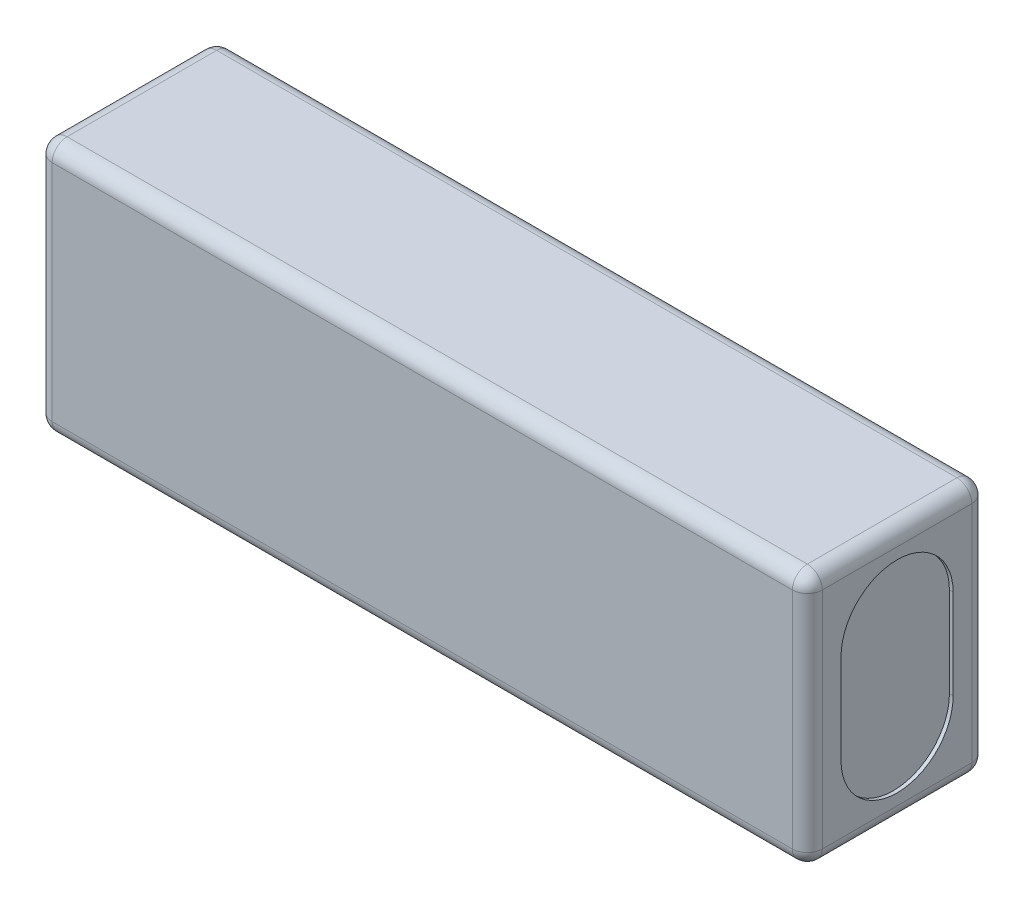
ISO-10303-21;
HEADER;
FILE_DESCRIPTION(('STEP AP214'),'2;1');
FILE_NAME('part.step','',(''),(''),'','','');
FILE_SCHEMA(('AUTOMOTIVE_DESIGN { 1 0 10303 214 1 1 1 1 }'));
ENDSEC;
DATA;
#1=APPLICATION_CONTEXT('core data for automotive mechanical design processes');
#2=APPLICATION_PROTOCOL_DEFINITION('international standard','automotive_design',2000,#1);
#3=PRODUCT_CONTEXT('',#1,'mechanical');
#4=PRODUCT('Part','Part','',(#3));
#5=PRODUCT_RELATED_PRODUCT_CATEGORY('part','',(#4));
#6=PRODUCT_DEFINITION_FORMATION('','',#4);
#7=PRODUCT_DEFINITION_CONTEXT('part definition',#1,'design');
#8=PRODUCT_DEFINITION('design','',#6,#7);
#9=PRODUCT_DEFINITION_SHAPE('','',#8);
#10=(LENGTH_UNIT() NAMED_UNIT(*) SI_UNIT(.MILLI.,.METRE.));
#11=(NAMED_UNIT(*) PLANE_ANGLE_UNIT() SI_UNIT($,.RADIAN.));
#12=(NAMED_UNIT(*) SI_UNIT($,.STERADIAN.) SOLID_ANGLE_UNIT());
#13=UNCERTAINTY_MEASURE_WITH_UNIT(LENGTH_MEASURE(1.E-05),#10,'distance_accuracy_value','');
#14=(GEOMETRIC_REPRESENTATION_CONTEXT(3) GLOBAL_UNCERTAINTY_ASSIGNED_CONTEXT((#13)) GLOBAL_UNIT_ASSIGNED_CONTEXT((#10,
#11,#12)) REPRESENTATION_CONTEXT('',''));
#15=CARTESIAN_POINT('',(0.,0.,0.));
#16=DIRECTION('',(0.,0.,1.));
#17=DIRECTION('',(1.,0.,0.));
#18=AXIS2_PLACEMENT_3D('',#15,#16,#17);
#19=CARTESIAN_POINT('',(-51.5,17.,24.));
#20=DIRECTION('',(1.,0.,0.));
#21=DIRECTION('',(0.,1.,0.));
#22=AXIS2_PLACEMENT_3D('',#19,#20,#21);
#23=PLANE('',#22);
#24=DIRECTION('',(0.,-1.,0.));
#25=VECTOR('',#24,1.);
#26=CARTESIAN_POINT('',(-51.5,17.,2.));
#27=LINE('',#26,#25);
#28=CARTESIAN_POINT('',(-51.5,15.,2.));
#29=VERTEX_POINT('',#28);
#30=CARTESIAN_POINT('',(-51.5,-15.,2.));
#31=VERTEX_POINT('',#30);
#32=EDGE_CURVE('E260',#29,#31,#27,.T.);
#33=ORIENTED_EDGE('',*,*,#32,.T.);
#34=DIRECTION('',(0.,0.,-1.));
#35=VECTOR('',#34,1.);
#36=CARTESIAN_POINT('',(-51.5,-15.,24.));
#37=LINE('',#36,#35);
#38=CARTESIAN_POINT('',(-51.5,-15.,22.));
#39=VERTEX_POINT('',#38);
#40=EDGE_CURVE('E262',#31,#39,#37,.F.);
#41=ORIENTED_EDGE('',*,*,#40,.T.);
#42=DIRECTION('',(0.,-1.,0.));
#43=VECTOR('',#42,1.);
#44=CARTESIAN_POINT('',(-51.5,17.,22.));
#45=LINE('',#44,#43);
#46=CARTESIAN_POINT('',(-51.5,15.,22.));
#47=VERTEX_POINT('',#46);
#48=EDGE_CURVE('E256',#39,#47,#45,.F.);
#49=ORIENTED_EDGE('',*,*,#48,.T.);
#50=DIRECTION('',(0.,0.,-1.));
#51=VECTOR('',#50,1.);
#52=CARTESIAN_POINT('',(-51.5,15.,24.));
#53=LINE('',#52,#51);
#54=EDGE_CURVE('E258',#47,#29,#53,.T.);
#55=ORIENTED_EDGE('',*,*,#54,.T.);
#56=EDGE_LOOP('',(#33,#41,#49,#55));
#57=FACE_BOUND('',#56,.T.);
#58=CARTESIAN_POINT('',(-51.5,6.,12.));
#59=DIRECTION('',(1.,0.,0.));
#60=DIRECTION('',(0.,1.,0.));
#61=AXIS2_PLACEMENT_3D('',#58,#59,#60);
#62=CIRCLE('',#61,7.5);
#63=CARTESIAN_POINT('',(-51.5,6.00000000000001,4.5));
#64=VERTEX_POINT('',#63);
#65=CARTESIAN_POINT('',(-51.5,6.,19.5));
#66=VERTEX_POINT('',#65);
#67=EDGE_CURVE('E193',#64,#66,#62,.T.);
#68=ORIENTED_EDGE('',*,*,#67,.T.);
#69=DIRECTION('',(0.,-1.,0.));
#70=VECTOR('',#69,1.);
#71=CARTESIAN_POINT('',(-51.5,6.,19.5));
#72=LINE('',#71,#70);
#73=CARTESIAN_POINT('',(-51.5,-6.,19.5));
#74=VERTEX_POINT('',#73);
#75=EDGE_CURVE('E197',#66,#74,#72,.T.);
#76=ORIENTED_EDGE('',*,*,#75,.T.);
#77=CARTESIAN_POINT('',(-51.5,-6.,12.));
#78=DIRECTION('',(1.,0.,0.));
#79=DIRECTION('',(0.,1.,0.));
#80=AXIS2_PLACEMENT_3D('',#77,#78,#79);
#81=CIRCLE('',#80,7.5);
#82=CARTESIAN_POINT('',(-51.5,-6.,4.5));
#83=VERTEX_POINT('',#82);
#84=EDGE_CURVE('E200',#74,#83,#81,.T.);
#85=ORIENTED_EDGE('',*,*,#84,.T.);
#86=DIRECTION('',(0.,1.,0.));
#87=VECTOR('',#86,1.);
#88=CARTESIAN_POINT('',(-51.5,6.00000000000001,4.5));
#89=LINE('',#88,#87);
#90=EDGE_CURVE('E206',#83,#64,#89,.T.);
#91=ORIENTED_EDGE('',*,*,#90,.T.);
#92=EDGE_LOOP('',(#68,#76,#85,#91));
#93=FACE_BOUND('',#92,.T.);
#94=ADVANCED_FACE('F36',(#57,#93),#23,.F.);
#95=CARTESIAN_POINT('',(51.5,17.,24.));
#96=DIRECTION('',(-1.,0.,0.));
#97=DIRECTION('',(0.,-1.,0.));
#98=AXIS2_PLACEMENT_3D('',#95,#96,#97);
#99=PLANE('',#98);
#100=DIRECTION('',(0.,1.,0.));
#101=VECTOR('',#100,1.);
#102=CARTESIAN_POINT('',(51.5,-17.,22.));
#103=LINE('',#102,#101);
#104=CARTESIAN_POINT('',(51.5,15.,22.));
#105=VERTEX_POINT('',#104);
#106=CARTESIAN_POINT('',(51.5,-15.,22.));
#107=VERTEX_POINT('',#106);
#108=EDGE_CURVE('E265',#105,#107,#103,.F.);
#109=ORIENTED_EDGE('',*,*,#108,.T.);
#110=DIRECTION('',(0.,0.,-1.));
#111=VECTOR('',#110,1.);
#112=CARTESIAN_POINT('',(51.5,-15.,24.));
#113=LINE('',#112,#111);
#114=CARTESIAN_POINT('',(51.5,-15.,2.));
#115=VERTEX_POINT('',#114);
#116=EDGE_CURVE('E271',#107,#115,#113,.T.);
#117=ORIENTED_EDGE('',*,*,#116,.T.);
#118=DIRECTION('',(0.,1.,0.));
#119=VECTOR('',#118,1.);
#120=CARTESIAN_POINT('',(51.5,17.,2.));
#121=LINE('',#120,#119);
#122=CARTESIAN_POINT('',(51.5,15.,2.));
#123=VERTEX_POINT('',#122);
#124=EDGE_CURVE('E269',#115,#123,#121,.T.);
#125=ORIENTED_EDGE('',*,*,#124,.T.);
#126=DIRECTION('',(0.,0.,-1.));
#127=VECTOR('',#126,1.);
#128=CARTESIAN_POINT('',(51.5,15.,24.));
#129=LINE('',#128,#127);
#130=EDGE_CURVE('E267',#123,#105,#129,.F.);
#131=ORIENTED_EDGE('',*,*,#130,.T.);
#132=EDGE_LOOP('',(#109,#117,#125,#131));
#133=FACE_BOUND('',#132,.T.);
#134=DIRECTION('',(0.,-1.,0.));
#135=VECTOR('',#134,1.);
#136=CARTESIAN_POINT('',(51.5,6.,19.5));
#137=LINE('',#136,#135);
#138=CARTESIAN_POINT('',(51.5,6.,19.5));
#139=VERTEX_POINT('',#138);
#140=CARTESIAN_POINT('',(51.5,-6.,19.5));
#141=VERTEX_POINT('',#140);
#142=EDGE_CURVE('E231',#139,#141,#137,.T.);
#143=ORIENTED_EDGE('',*,*,#142,.F.);
#144=CARTESIAN_POINT('',(51.5,6.,12.));
#145=DIRECTION('',(1.,0.,0.));
#146=DIRECTION('',(0.,1.,0.));
#147=AXIS2_PLACEMENT_3D('',#144,#145,#146);
#148=CIRCLE('',#147,7.5);
#149=CARTESIAN_POINT('',(51.5,6.00000000000001,4.5));
#150=VERTEX_POINT('',#149);
#151=EDGE_CURVE('E212',#150,#139,#148,.T.);
#152=ORIENTED_EDGE('',*,*,#151,.F.);
#153=DIRECTION('',(0.,1.,0.));
#154=VECTOR('',#153,1.);
#155=CARTESIAN_POINT('',(51.5,6.00000000000001,4.5));
#156=LINE('',#155,#154);
#157=CARTESIAN_POINT('',(51.5,-6.,4.5));
#158=VERTEX_POINT('',#157);
#159=EDGE_CURVE('E220',#158,#150,#156,.T.);
#160=ORIENTED_EDGE('',*,*,#159,.F.);
#161=CARTESIAN_POINT('',(51.5,-6.,12.));
#162=DIRECTION('',(1.,0.,0.));
#163=DIRECTION('',(0.,1.,0.));
#164=AXIS2_PLACEMENT_3D('',#161,#162,#163);
#165=CIRCLE('',#164,7.5);
#166=EDGE_CURVE('E234',#141,#158,#165,.T.);
#167=ORIENTED_EDGE('',*,*,#166,.F.);
#168=EDGE_LOOP('',(#143,#152,#160,#167));
#169=FACE_BOUND('',#168,.T.);
#170=ADVANCED_FACE('F399',(#133,#169),#99,.F.);
#171=CARTESIAN_POINT('',(-51.5,17.,24.));
#172=DIRECTION('',(0.,-1.,0.));
#173=DIRECTION('',(0.,0.,-1.));
#174=AXIS2_PLACEMENT_3D('',#171,#172,#173);
#175=PLANE('',#174);
#176=DIRECTION('',(0.,0.,-1.));
#177=VECTOR('',#176,1.);
#178=CARTESIAN_POINT('',(49.5,17.,24.));
#179=LINE('',#178,#177);
#180=CARTESIAN_POINT('',(49.5,17.,22.));
#181=VERTEX_POINT('',#180);
#182=CARTESIAN_POINT('',(49.5,17.,2.));
#183=VERTEX_POINT('',#182);
#184=EDGE_CURVE('E287',#181,#183,#179,.T.);
#185=ORIENTED_EDGE('',*,*,#184,.T.);
#186=DIRECTION('',(-1.,0.,0.));
#187=VECTOR('',#186,1.);
#188=CARTESIAN_POINT('',(-51.5,17.,2.));
#189=LINE('',#188,#187);
#190=CARTESIAN_POINT('',(-49.5,17.,2.));
#191=VERTEX_POINT('',#190);
#192=EDGE_CURVE('E290',#183,#191,#189,.T.);
#193=ORIENTED_EDGE('',*,*,#192,.T.);
#194=DIRECTION('',(0.,0.,-1.));
#195=VECTOR('',#194,1.);
#196=CARTESIAN_POINT('',(-49.5,17.,24.));
#197=LINE('',#196,#195);
#198=CARTESIAN_POINT('',(-49.5,17.,22.));
#199=VERTEX_POINT('',#198);
#200=EDGE_CURVE('E285',#191,#199,#197,.F.);
#201=ORIENTED_EDGE('',*,*,#200,.T.);
#202=DIRECTION('',(-1.,0.,0.));
#203=VECTOR('',#202,1.);
#204=CARTESIAN_POINT('',(51.5,17.,22.));
#205=LINE('',#204,#203);
#206=EDGE_CURVE('E283',#199,#181,#205,.F.);
#207=ORIENTED_EDGE('',*,*,#206,.T.);
#208=EDGE_LOOP('',(#185,#193,#201,#207));
#209=FACE_BOUND('',#208,.T.);
#210=ADVANCED_FACE('F414',(#209),#175,.F.);
#211=CARTESIAN_POINT('',(-51.5,-17.,24.));
#212=DIRECTION('',(0.,1.,0.));
#213=DIRECTION('',(0.,0.,1.));
#214=AXIS2_PLACEMENT_3D('',#211,#212,#213);
#215=PLANE('',#214);
#216=DIRECTION('',(0.,0.,-1.));
#217=VECTOR('',#216,1.);
#218=CARTESIAN_POINT('',(-49.5,-17.,24.));
#219=LINE('',#218,#217);
#220=CARTESIAN_POINT('',(-49.5,-17.,22.));
#221=VERTEX_POINT('',#220);
#222=CARTESIAN_POINT('',(-49.5,-17.,2.));
#223=VERTEX_POINT('',#222);
#224=EDGE_CURVE('E251',#221,#223,#219,.T.);
#225=ORIENTED_EDGE('',*,*,#224,.T.);
#226=DIRECTION('',(1.,0.,0.));
#227=VECTOR('',#226,1.);
#228=CARTESIAN_POINT('',(-51.5,-17.,2.));
#229=LINE('',#228,#227);
#230=CARTESIAN_POINT('',(49.5,-17.,2.));
#231=VERTEX_POINT('',#230);
#232=EDGE_CURVE('E254',#223,#231,#229,.T.);
#233=ORIENTED_EDGE('',*,*,#232,.T.);
#234=DIRECTION('',(0.,0.,-1.));
#235=VECTOR('',#234,1.);
#236=CARTESIAN_POINT('',(49.5,-17.,24.));
#237=LINE('',#236,#235);
#238=CARTESIAN_POINT('',(49.5,-17.,22.));
#239=VERTEX_POINT('',#238);
#240=EDGE_CURVE('E249',#231,#239,#237,.F.);
#241=ORIENTED_EDGE('',*,*,#240,.T.);
#242=DIRECTION('',(1.,0.,0.));
#243=VECTOR('',#242,1.);
#244=CARTESIAN_POINT('',(-51.5,-17.,22.));
#245=LINE('',#244,#243);
#246=EDGE_CURVE('E241',#239,#221,#245,.F.);
#247=ORIENTED_EDGE('',*,*,#246,.T.);
#248=EDGE_LOOP('',(#225,#233,#241,#247));
#249=FACE_BOUND('',#248,.T.);
#250=ADVANCED_FACE('F446',(#249),#215,.F.);
#251=CARTESIAN_POINT('',(0.,0.,24.));
#252=DIRECTION('',(0.,0.,1.));
#253=DIRECTION('',(1.,0.,0.));
#254=AXIS2_PLACEMENT_3D('',#251,#252,#253);
#255=PLANE('',#254);
#256=DIRECTION('',(0.,-1.,0.));
#257=VECTOR('',#256,1.);
#258=CARTESIAN_POINT('',(-49.5,-17.,24.));
#259=LINE('',#258,#257);
#260=CARTESIAN_POINT('',(-49.5,15.,24.));
#261=VERTEX_POINT('',#260);
#262=CARTESIAN_POINT('',(-49.5,-15.,24.));
#263=VERTEX_POINT('',#262);
#264=EDGE_CURVE('E45',#261,#263,#259,.T.);
#265=ORIENTED_EDGE('',*,*,#264,.T.);
#266=DIRECTION('',(1.,0.,0.));
#267=VECTOR('',#266,1.);
#268=CARTESIAN_POINT('',(51.5,-15.,24.));
#269=LINE('',#268,#267);
#270=CARTESIAN_POINT('',(49.5,-15.,24.));
#271=VERTEX_POINT('',#270);
#272=EDGE_CURVE('E11',#263,#271,#269,.T.);
#273=ORIENTED_EDGE('',*,*,#272,.T.);
#274=DIRECTION('',(0.,1.,0.));
#275=VECTOR('',#274,1.);
#276=CARTESIAN_POINT('',(49.5,17.,24.));
#277=LINE('',#276,#275);
#278=CARTESIAN_POINT('',(49.5,15.,24.));
#279=VERTEX_POINT('',#278);
#280=EDGE_CURVE('E292',#271,#279,#277,.T.);
#281=ORIENTED_EDGE('',*,*,#280,.T.);
#282=DIRECTION('',(-1.,0.,0.));
#283=VECTOR('',#282,1.);
#284=CARTESIAN_POINT('',(-51.5,15.,24.));
#285=LINE('',#284,#283);
#286=EDGE_CURVE('E56',#279,#261,#285,.T.);
#287=ORIENTED_EDGE('',*,*,#286,.T.);
#288=EDGE_LOOP('',(#265,#273,#281,#287));
#289=FACE_BOUND('',#288,.T.);
#290=ADVANCED_FACE('F392',(#289),#255,.T.);
#291=CARTESIAN_POINT('',(0.,0.,0.));
#292=DIRECTION('',(0.,0.,1.));
#293=DIRECTION('',(1.,0.,0.));
#294=AXIS2_PLACEMENT_3D('',#291,#292,#293);
#295=PLANE('',#294);
#296=DIRECTION('',(1.,0.,0.));
#297=VECTOR('',#296,1.);
#298=CARTESIAN_POINT('',(0.,-15.,0.));
#299=LINE('',#298,#297);
#300=CARTESIAN_POINT('',(49.5,-15.,0.));
#301=VERTEX_POINT('',#300);
#302=CARTESIAN_POINT('',(-49.5,-15.,0.));
#303=VERTEX_POINT('',#302);
#304=EDGE_CURVE('E278',#301,#303,#299,.F.);
#305=ORIENTED_EDGE('',*,*,#304,.T.);
#306=DIRECTION('',(0.,-1.,0.));
#307=VECTOR('',#306,1.);
#308=CARTESIAN_POINT('',(-49.5,0.,0.));
#309=LINE('',#308,#307);
#310=CARTESIAN_POINT('',(-49.5,15.,0.));
#311=VERTEX_POINT('',#310);
#312=EDGE_CURVE('E280',#303,#311,#309,.F.);
#313=ORIENTED_EDGE('',*,*,#312,.T.);
#314=DIRECTION('',(-1.,0.,0.));
#315=VECTOR('',#314,1.);
#316=CARTESIAN_POINT('',(0.,15.,0.));
#317=LINE('',#316,#315);
#318=CARTESIAN_POINT('',(49.5,15.,0.));
#319=VERTEX_POINT('',#318);
#320=EDGE_CURVE('E274',#311,#319,#317,.F.);
#321=ORIENTED_EDGE('',*,*,#320,.T.);
#322=DIRECTION('',(0.,1.,0.));
#323=VECTOR('',#322,1.);
#324=CARTESIAN_POINT('',(49.5,0.,0.));
#325=LINE('',#324,#323);
#326=EDGE_CURVE('E276',#319,#301,#325,.F.);
#327=ORIENTED_EDGE('',*,*,#326,.T.);
#328=EDGE_LOOP('',(#305,#313,#321,#327));
#329=FACE_BOUND('',#328,.T.);
#330=ADVANCED_FACE('F453',(#329),#295,.F.);
#331=CARTESIAN_POINT('',(51.,6.,12.));
#332=DIRECTION('',(1.,0.,0.));
#333=DIRECTION('',(0.,1.,0.));
#334=AXIS2_PLACEMENT_3D('',#331,#332,#333);
#335=CYLINDRICAL_SURFACE('',#334,7.5);
#336=ORIENTED_EDGE('',*,*,#151,.T.);
#337=DIRECTION('',(1.,0.,0.));
#338=VECTOR('',#337,1.);
#339=CARTESIAN_POINT('',(51.,6.,19.5));
#340=LINE('',#339,#338);
#341=CARTESIAN_POINT('',(51.,6.,19.5));
#342=VERTEX_POINT('',#341);
#343=EDGE_CURVE('E229',#342,#139,#340,.T.);
#344=ORIENTED_EDGE('',*,*,#343,.F.);
#345=CARTESIAN_POINT('',(51.,6.,12.));
#346=DIRECTION('',(1.,0.,0.));
#347=DIRECTION('',(0.,1.,0.));
#348=AXIS2_PLACEMENT_3D('',#345,#346,#347);
#349=CIRCLE('',#348,7.5);
#350=CARTESIAN_POINT('',(51.,6.00000000000001,4.5));
#351=VERTEX_POINT('',#350);
#352=EDGE_CURVE('E216',#351,#342,#349,.T.);
#353=ORIENTED_EDGE('',*,*,#352,.F.);
#354=DIRECTION('',(1.,0.,0.));
#355=VECTOR('',#354,1.);
#356=CARTESIAN_POINT('',(51.,6.00000000000001,4.5));
#357=LINE('',#356,#355);
#358=EDGE_CURVE('E239',#351,#150,#357,.T.);
#359=ORIENTED_EDGE('',*,*,#358,.T.);
#360=EDGE_LOOP('',(#336,#344,#353,#359));
#361=FACE_BOUND('',#360,.T.);
#362=ADVANCED_FACE('F535',(#361),#335,.F.);
#363=CARTESIAN_POINT('',(51.,6.00000000000001,4.5));
#364=DIRECTION('',(0.,0.,-1.));
#365=DIRECTION('',(0.,1.,0.));
#366=AXIS2_PLACEMENT_3D('',#363,#364,#365);
#367=PLANE('',#366);
#368=ORIENTED_EDGE('',*,*,#159,.T.);
#369=ORIENTED_EDGE('',*,*,#358,.F.);
#370=DIRECTION('',(0.,1.,0.));
#371=VECTOR('',#370,1.);
#372=CARTESIAN_POINT('',(51.,6.00000000000001,4.5));
#373=LINE('',#372,#371);
#374=CARTESIAN_POINT('',(51.,-6.,4.5));
#375=VERTEX_POINT('',#374);
#376=EDGE_CURVE('E226',#375,#351,#373,.T.);
#377=ORIENTED_EDGE('',*,*,#376,.F.);
#378=DIRECTION('',(1.,0.,0.));
#379=VECTOR('',#378,1.);
#380=CARTESIAN_POINT('',(51.,-6.,4.5));
#381=LINE('',#380,#379);
#382=EDGE_CURVE('E242',#375,#158,#381,.T.);
#383=ORIENTED_EDGE('',*,*,#382,.T.);
#384=EDGE_LOOP('',(#368,#369,#377,#383));
#385=FACE_BOUND('',#384,.T.);
#386=ADVANCED_FACE('F531',(#385),#367,.F.);
#387=CARTESIAN_POINT('',(51.,-6.,12.));
#388=DIRECTION('',(1.,0.,0.));
#389=DIRECTION('',(0.,1.,0.));
#390=AXIS2_PLACEMENT_3D('',#387,#388,#389);
#391=CYLINDRICAL_SURFACE('',#390,7.5);
#392=ORIENTED_EDGE('',*,*,#166,.T.);
#393=ORIENTED_EDGE('',*,*,#382,.F.);
#394=CARTESIAN_POINT('',(51.,-6.,12.));
#395=DIRECTION('',(1.,0.,0.));
#396=DIRECTION('',(0.,1.,0.));
#397=AXIS2_PLACEMENT_3D('',#394,#395,#396);
#398=CIRCLE('',#397,7.5);
#399=CARTESIAN_POINT('',(51.,-6.,19.5));
#400=VERTEX_POINT('',#399);
#401=EDGE_CURVE('E223',#400,#375,#398,.T.);
#402=ORIENTED_EDGE('',*,*,#401,.F.);
#403=DIRECTION('',(1.,0.,0.));
#404=VECTOR('',#403,1.);
#405=CARTESIAN_POINT('',(51.,-6.,19.5));
#406=LINE('',#405,#404);
#407=EDGE_CURVE('E244',#400,#141,#406,.T.);
#408=ORIENTED_EDGE('',*,*,#407,.T.);
#409=EDGE_LOOP('',(#392,#393,#402,#408));
#410=FACE_BOUND('',#409,.T.);
#411=ADVANCED_FACE('F534',(#410),#391,.F.);
#412=CARTESIAN_POINT('',(51.,6.,19.5));
#413=DIRECTION('',(0.,0.,1.));
#414=DIRECTION('',(0.,-1.,0.));
#415=AXIS2_PLACEMENT_3D('',#412,#413,#414);
#416=PLANE('',#415);
#417=ORIENTED_EDGE('',*,*,#142,.T.);
#418=ORIENTED_EDGE('',*,*,#407,.F.);
#419=DIRECTION('',(0.,-1.,0.));
#420=VECTOR('',#419,1.);
#421=CARTESIAN_POINT('',(51.,6.,19.5));
#422=LINE('',#421,#420);
#423=EDGE_CURVE('E219',#342,#400,#422,.T.);
#424=ORIENTED_EDGE('',*,*,#423,.F.);
#425=ORIENTED_EDGE('',*,*,#343,.T.);
#426=EDGE_LOOP('',(#417,#418,#424,#425));
#427=FACE_BOUND('',#426,.T.);
#428=ADVANCED_FACE('F529',(#427),#416,.F.);
#429=CARTESIAN_POINT('',(51.,6.,12.));
#430=DIRECTION('',(1.,0.,0.));
#431=DIRECTION('',(0.,1.,0.));
#432=AXIS2_PLACEMENT_3D('',#429,#430,#431);
#433=PLANE('',#432);
#434=ORIENTED_EDGE('',*,*,#352,.T.);
#435=ORIENTED_EDGE('',*,*,#423,.T.);
#436=ORIENTED_EDGE('',*,*,#401,.T.);
#437=ORIENTED_EDGE('',*,*,#376,.T.);
#438=EDGE_LOOP('',(#434,#435,#436,#437));
#439=FACE_BOUND('',#438,.T.);
#440=ADVANCED_FACE('F526',(#439),#433,.T.);
#441=CARTESIAN_POINT('',(-51.,6.,12.));
#442=DIRECTION('',(-1.,0.,0.));
#443=DIRECTION('',(0.,-1.,0.));
#444=AXIS2_PLACEMENT_3D('',#441,#442,#443);
#445=CYLINDRICAL_SURFACE('',#444,7.5);
#446=ORIENTED_EDGE('',*,*,#67,.F.);
#447=DIRECTION('',(-1.,0.,0.));
#448=VECTOR('',#447,1.);
#449=CARTESIAN_POINT('',(-51.,6.00000000000001,4.5));
#450=LINE('',#449,#448);
#451=CARTESIAN_POINT('',(-51.,6.00000000000001,4.5));
#452=VERTEX_POINT('',#451);
#453=EDGE_CURVE('E178',#452,#64,#450,.T.);
#454=ORIENTED_EDGE('',*,*,#453,.F.);
#455=CARTESIAN_POINT('',(-51.,6.,12.));
#456=DIRECTION('',(1.,0.,0.));
#457=DIRECTION('',(0.,1.,0.));
#458=AXIS2_PLACEMENT_3D('',#455,#456,#457);
#459=CIRCLE('',#458,7.5);
#460=CARTESIAN_POINT('',(-51.,6.,19.5));
#461=VERTEX_POINT('',#460);
#462=EDGE_CURVE('E185',#452,#461,#459,.T.);
#463=ORIENTED_EDGE('',*,*,#462,.T.);
#464=DIRECTION('',(-1.,0.,0.));
#465=VECTOR('',#464,1.);
#466=CARTESIAN_POINT('',(-51.,6.,19.5));
#467=LINE('',#466,#465);
#468=EDGE_CURVE('E210',#461,#66,#467,.T.);
#469=ORIENTED_EDGE('',*,*,#468,.T.);
#470=EDGE_LOOP('',(#446,#454,#463,#469));
#471=FACE_BOUND('',#470,.T.);
#472=ADVANCED_FACE('F189',(#471),#445,.F.);
#473=CARTESIAN_POINT('',(-51.,6.,19.5));
#474=DIRECTION('',(0.,0.,-1.));
#475=DIRECTION('',(0.,1.,0.));
#476=AXIS2_PLACEMENT_3D('',#473,#474,#475);
#477=PLANE('',#476);
#478=ORIENTED_EDGE('',*,*,#75,.F.);
#479=ORIENTED_EDGE('',*,*,#468,.F.);
#480=DIRECTION('',(0.,-1.,0.));
#481=VECTOR('',#480,1.);
#482=CARTESIAN_POINT('',(-51.,6.,19.5));
#483=LINE('',#482,#481);
#484=CARTESIAN_POINT('',(-51.,-6.,19.5));
#485=VERTEX_POINT('',#484);
#486=EDGE_CURVE('E194',#461,#485,#483,.T.);
#487=ORIENTED_EDGE('',*,*,#486,.T.);
#488=DIRECTION('',(-1.,0.,0.));
#489=VECTOR('',#488,1.);
#490=CARTESIAN_POINT('',(-51.,-6.,19.5));
#491=LINE('',#490,#489);
#492=EDGE_CURVE('E213',#485,#74,#491,.T.);
#493=ORIENTED_EDGE('',*,*,#492,.T.);
#494=EDGE_LOOP('',(#478,#479,#487,#493));
#495=FACE_BOUND('',#494,.T.);
#496=ADVANCED_FACE('F517',(#495),#477,.T.);
#497=CARTESIAN_POINT('',(-51.,-6.,12.));
#498=DIRECTION('',(-1.,0.,0.));
#499=DIRECTION('',(0.,-1.,0.));
#500=AXIS2_PLACEMENT_3D('',#497,#498,#499);
#501=CYLINDRICAL_SURFACE('',#500,7.5);
#502=ORIENTED_EDGE('',*,*,#84,.F.);
#503=ORIENTED_EDGE('',*,*,#492,.F.);
#504=CARTESIAN_POINT('',(-51.,-6.,12.));
#505=DIRECTION('',(1.,0.,0.));
#506=DIRECTION('',(0.,1.,0.));
#507=AXIS2_PLACEMENT_3D('',#504,#505,#506);
#508=CIRCLE('',#507,7.5);
#509=CARTESIAN_POINT('',(-51.,-6.,4.5));
#510=VERTEX_POINT('',#509);
#511=EDGE_CURVE('E184',#485,#510,#508,.T.);
#512=ORIENTED_EDGE('',*,*,#511,.T.);
#513=DIRECTION('',(-1.,0.,0.));
#514=VECTOR('',#513,1.);
#515=CARTESIAN_POINT('',(-51.,-6.,4.5));
#516=LINE('',#515,#514);
#517=EDGE_CURVE('E180',#510,#83,#516,.T.);
#518=ORIENTED_EDGE('',*,*,#517,.T.);
#519=EDGE_LOOP('',(#502,#503,#512,#518));
#520=FACE_BOUND('',#519,.T.);
#521=ADVANCED_FACE('F514',(#520),#501,.F.);
#522=CARTESIAN_POINT('',(-51.,6.00000000000001,4.5));
#523=DIRECTION('',(0.,0.,1.));
#524=DIRECTION('',(0.,-1.,0.));
#525=AXIS2_PLACEMENT_3D('',#522,#523,#524);
#526=PLANE('',#525);
#527=ORIENTED_EDGE('',*,*,#90,.F.);
#528=ORIENTED_EDGE('',*,*,#517,.F.);
#529=DIRECTION('',(0.,1.,0.));
#530=VECTOR('',#529,1.);
#531=CARTESIAN_POINT('',(-51.,6.00000000000001,4.5));
#532=LINE('',#531,#530);
#533=EDGE_CURVE('E174',#510,#452,#532,.T.);
#534=ORIENTED_EDGE('',*,*,#533,.T.);
#535=ORIENTED_EDGE('',*,*,#453,.T.);
#536=EDGE_LOOP('',(#527,#528,#534,#535));
#537=FACE_BOUND('',#536,.T.);
#538=ADVANCED_FACE('F177',(#537),#526,.T.);
#539=CARTESIAN_POINT('',(-51.,6.,12.));
#540=DIRECTION('',(-1.,0.,0.));
#541=DIRECTION('',(0.,1.,0.));
#542=AXIS2_PLACEMENT_3D('',#539,#540,#541);
#543=PLANE('',#542);
#544=ORIENTED_EDGE('',*,*,#462,.F.);
#545=ORIENTED_EDGE('',*,*,#533,.F.);
#546=ORIENTED_EDGE('',*,*,#511,.F.);
#547=ORIENTED_EDGE('',*,*,#486,.F.);
#548=EDGE_LOOP('',(#544,#545,#546,#547));
#549=FACE_BOUND('',#548,.T.);
#550=ADVANCED_FACE('F196',(#549),#543,.T.);
#551=CARTESIAN_POINT('',(49.5,15.,24.));
#552=DIRECTION('',(0.,0.,-1.));
#553=DIRECTION('',(-1.,0.,0.));
#554=AXIS2_PLACEMENT_3D('',#551,#552,#553);
#555=CYLINDRICAL_SURFACE('',#554,2.);
#556=CARTESIAN_POINT('',(49.5,15.,22.));
#557=DIRECTION('',(0.,0.,1.));
#558=DIRECTION('',(1.,0.,0.));
#559=AXIS2_PLACEMENT_3D('',#556,#557,#558);
#560=CIRCLE('',#559,2.);
#561=EDGE_CURVE('E40',#105,#181,#560,.T.);
#562=ORIENTED_EDGE('',*,*,#561,.F.);
#563=ORIENTED_EDGE('',*,*,#130,.F.);
#564=CARTESIAN_POINT('',(49.5,15.,2.));
#565=DIRECTION('',(0.,0.,-1.));
#566=DIRECTION('',(-1.,0.,0.));
#567=AXIS2_PLACEMENT_3D('',#564,#565,#566);
#568=CIRCLE('',#567,2.);
#569=EDGE_CURVE('E356',#183,#123,#568,.T.);
#570=ORIENTED_EDGE('',*,*,#569,.F.);
#571=ORIENTED_EDGE('',*,*,#184,.F.);
#572=EDGE_LOOP('',(#562,#563,#570,#571));
#573=FACE_BOUND('',#572,.T.);
#574=ADVANCED_FACE('F38',(#573),#555,.T.);
#575=CARTESIAN_POINT('',(49.5,15.,22.));
#576=DIRECTION('',(0.,0.,1.));
#577=DIRECTION('',(1.,0.,0.));
#578=AXIS2_PLACEMENT_3D('',#575,#576,#577);
#579=SPHERICAL_SURFACE('',#578,2.);
#580=CARTESIAN_POINT('',(49.5,15.,22.));
#581=DIRECTION('',(0.,1.,0.));
#582=DIRECTION('',(0.,0.,1.));
#583=AXIS2_PLACEMENT_3D('',#580,#581,#582);
#584=CIRCLE('',#583,2.);
#585=EDGE_CURVE('E351',#105,#279,#584,.F.);
#586=ORIENTED_EDGE('',*,*,#585,.F.);
#587=ORIENTED_EDGE('',*,*,#561,.T.);
#588=CARTESIAN_POINT('',(49.5,15.,22.));
#589=DIRECTION('',(1.,0.,0.));
#590=DIRECTION('',(0.,0.,-1.));
#591=AXIS2_PLACEMENT_3D('',#588,#589,#590);
#592=CIRCLE('',#591,2.);
#593=EDGE_CURVE('E354',#279,#181,#592,.F.);
#594=ORIENTED_EDGE('',*,*,#593,.F.);
#595=EDGE_LOOP('',(#586,#587,#594));
#596=FACE_BOUND('',#595,.T.);
#597=ADVANCED_FACE('F367',(#596),#579,.T.);
#598=CARTESIAN_POINT('',(49.5,15.,2.));
#599=DIRECTION('',(0.,0.,1.));
#600=DIRECTION('',(1.,0.,0.));
#601=AXIS2_PLACEMENT_3D('',#598,#599,#600);
#602=SPHERICAL_SURFACE('',#601,2.);
#603=CARTESIAN_POINT('',(49.5,15.,2.));
#604=DIRECTION('',(1.,0.,0.));
#605=DIRECTION('',(0.,0.,-1.));
#606=AXIS2_PLACEMENT_3D('',#603,#604,#605);
#607=CIRCLE('',#606,2.);
#608=EDGE_CURVE('E345',#183,#319,#607,.F.);
#609=ORIENTED_EDGE('',*,*,#608,.F.);
#610=ORIENTED_EDGE('',*,*,#569,.T.);
#611=CARTESIAN_POINT('',(49.5,15.,2.));
#612=DIRECTION('',(0.,1.,0.));
#613=DIRECTION('',(0.,0.,1.));
#614=AXIS2_PLACEMENT_3D('',#611,#612,#613);
#615=CIRCLE('',#614,2.);
#616=EDGE_CURVE('E348',#319,#123,#615,.F.);
#617=ORIENTED_EDGE('',*,*,#616,.F.);
#618=EDGE_LOOP('',(#609,#610,#617));
#619=FACE_BOUND('',#618,.T.);
#620=ADVANCED_FACE('F501',(#619),#602,.T.);
#621=CARTESIAN_POINT('',(0.,15.,22.));
#622=DIRECTION('',(1.,0.,0.));
#623=DIRECTION('',(0.,0.,-1.));
#624=AXIS2_PLACEMENT_3D('',#621,#622,#623);
#625=CYLINDRICAL_SURFACE('',#624,2.);
#626=ORIENTED_EDGE('',*,*,#593,.T.);
#627=ORIENTED_EDGE('',*,*,#206,.F.);
#628=CARTESIAN_POINT('',(-49.5,15.,22.));
#629=DIRECTION('',(-1.,0.,0.));
#630=DIRECTION('',(0.,0.,1.));
#631=AXIS2_PLACEMENT_3D('',#628,#629,#630);
#632=CIRCLE('',#631,2.);
#633=EDGE_CURVE('E339',#261,#199,#632,.T.);
#634=ORIENTED_EDGE('',*,*,#633,.F.);
#635=ORIENTED_EDGE('',*,*,#286,.F.);
#636=EDGE_LOOP('',(#626,#627,#634,#635));
#637=FACE_BOUND('',#636,.T.);
#638=ADVANCED_FACE('F374',(#637),#625,.T.);
#639=CARTESIAN_POINT('',(49.5,0.,22.));
#640=DIRECTION('',(0.,-1.,0.));
#641=DIRECTION('',(1.,0.,0.));
#642=AXIS2_PLACEMENT_3D('',#639,#640,#641);
#643=CYLINDRICAL_SURFACE('',#642,2.);
#644=ORIENTED_EDGE('',*,*,#585,.T.);
#645=ORIENTED_EDGE('',*,*,#280,.F.);
#646=CARTESIAN_POINT('',(49.5,-15.,22.));
#647=DIRECTION('',(0.,-1.,0.));
#648=DIRECTION('',(0.,0.,-1.));
#649=AXIS2_PLACEMENT_3D('',#646,#647,#648);
#650=CIRCLE('',#649,2.);
#651=EDGE_CURVE('E336',#107,#271,#650,.T.);
#652=ORIENTED_EDGE('',*,*,#651,.F.);
#653=ORIENTED_EDGE('',*,*,#108,.F.);
#654=EDGE_LOOP('',(#644,#645,#652,#653));
#655=FACE_BOUND('',#654,.T.);
#656=ADVANCED_FACE('F396',(#655),#643,.T.);
#657=CARTESIAN_POINT('',(49.5,-15.,24.));
#658=DIRECTION('',(0.,0.,-1.));
#659=DIRECTION('',(-1.,0.,0.));
#660=AXIS2_PLACEMENT_3D('',#657,#658,#659);
#661=CYLINDRICAL_SURFACE('',#660,2.);
#662=CARTESIAN_POINT('',(49.5,-15.,2.));
#663=DIRECTION('',(0.,0.,-1.));
#664=DIRECTION('',(-1.,0.,0.));
#665=AXIS2_PLACEMENT_3D('',#662,#663,#664);
#666=CIRCLE('',#665,2.);
#667=EDGE_CURVE('E330',#115,#231,#666,.T.);
#668=ORIENTED_EDGE('',*,*,#667,.F.);
#669=ORIENTED_EDGE('',*,*,#116,.F.);
#670=CARTESIAN_POINT('',(49.5,-15.,22.));
#671=DIRECTION('',(0.,0.,1.));
#672=DIRECTION('',(1.,0.,0.));
#673=AXIS2_PLACEMENT_3D('',#670,#671,#672);
#674=CIRCLE('',#673,2.);
#675=EDGE_CURVE('E333',#239,#107,#674,.T.);
#676=ORIENTED_EDGE('',*,*,#675,.F.);
#677=ORIENTED_EDGE('',*,*,#240,.F.);
#678=EDGE_LOOP('',(#668,#669,#676,#677));
#679=FACE_BOUND('',#678,.T.);
#680=ADVANCED_FACE('F404',(#679),#661,.T.);
#681=CARTESIAN_POINT('',(49.5,17.,2.));
#682=DIRECTION('',(0.,1.,0.));
#683=DIRECTION('',(-1.,0.,0.));
#684=AXIS2_PLACEMENT_3D('',#681,#682,#683);
#685=CYLINDRICAL_SURFACE('',#684,2.);
#686=ORIENTED_EDGE('',*,*,#616,.T.);
#687=ORIENTED_EDGE('',*,*,#124,.F.);
#688=CARTESIAN_POINT('',(49.5,-15.,2.));
#689=DIRECTION('',(0.,-1.,0.));
#690=DIRECTION('',(1.,0.,0.));
#691=AXIS2_PLACEMENT_3D('',#688,#689,#690);
#692=CIRCLE('',#691,2.);
#693=EDGE_CURVE('E328',#301,#115,#692,.T.);
#694=ORIENTED_EDGE('',*,*,#693,.F.);
#695=ORIENTED_EDGE('',*,*,#326,.F.);
#696=EDGE_LOOP('',(#686,#687,#694,#695));
#697=FACE_BOUND('',#696,.T.);
#698=ADVANCED_FACE('F411',(#697),#685,.T.);
#699=CARTESIAN_POINT('',(-51.5,15.,2.));
#700=DIRECTION('',(-1.,0.,0.));
#701=DIRECTION('',(0.,0.,1.));
#702=AXIS2_PLACEMENT_3D('',#699,#700,#701);
#703=CYLINDRICAL_SURFACE('',#702,2.);
#704=ORIENTED_EDGE('',*,*,#608,.T.);
#705=ORIENTED_EDGE('',*,*,#320,.F.);
#706=CARTESIAN_POINT('',(-49.5,15.,2.));
#707=DIRECTION('',(-1.,0.,0.));
#708=DIRECTION('',(0.,0.,1.));
#709=AXIS2_PLACEMENT_3D('',#706,#707,#708);
#710=CIRCLE('',#709,2.);
#711=EDGE_CURVE('E325',#191,#311,#710,.T.);
#712=ORIENTED_EDGE('',*,*,#711,.F.);
#713=ORIENTED_EDGE('',*,*,#192,.F.);
#714=EDGE_LOOP('',(#704,#705,#712,#713));
#715=FACE_BOUND('',#714,.T.);
#716=ADVANCED_FACE('F424',(#715),#703,.T.);
#717=CARTESIAN_POINT('',(-49.5,15.,24.));
#718=DIRECTION('',(0.,0.,-1.));
#719=DIRECTION('',(-1.,0.,0.));
#720=AXIS2_PLACEMENT_3D('',#717,#718,#719);
#721=CYLINDRICAL_SURFACE('',#720,2.);
#722=CARTESIAN_POINT('',(-49.5,15.,22.));
#723=DIRECTION('',(0.,0.,1.));
#724=DIRECTION('',(1.,0.,0.));
#725=AXIS2_PLACEMENT_3D('',#722,#723,#724);
#726=CIRCLE('',#725,2.);
#727=EDGE_CURVE('E342',#199,#47,#726,.T.);
#728=ORIENTED_EDGE('',*,*,#727,.F.);
#729=ORIENTED_EDGE('',*,*,#200,.F.);
#730=CARTESIAN_POINT('',(-49.5,15.,2.));
#731=DIRECTION('',(0.,0.,-1.));
#732=DIRECTION('',(-1.,0.,0.));
#733=AXIS2_PLACEMENT_3D('',#730,#731,#732);
#734=CIRCLE('',#733,2.);
#735=EDGE_CURVE('E322',#29,#191,#734,.T.);
#736=ORIENTED_EDGE('',*,*,#735,.F.);
#737=ORIENTED_EDGE('',*,*,#54,.F.);
#738=EDGE_LOOP('',(#728,#729,#736,#737));
#739=FACE_BOUND('',#738,.T.);
#740=ADVANCED_FACE('F419',(#739),#721,.T.);
#741=CARTESIAN_POINT('',(-49.5,15.,22.));
#742=DIRECTION('',(0.,0.,1.));
#743=DIRECTION('',(1.,0.,0.));
#744=AXIS2_PLACEMENT_3D('',#741,#742,#743);
#745=SPHERICAL_SURFACE('',#744,2.);
#746=ORIENTED_EDGE('',*,*,#633,.T.);
#747=ORIENTED_EDGE('',*,*,#727,.T.);
#748=CARTESIAN_POINT('',(-49.5,15.,22.));
#749=DIRECTION('',(0.,1.,0.));
#750=DIRECTION('',(0.,0.,1.));
#751=AXIS2_PLACEMENT_3D('',#748,#749,#750);
#752=CIRCLE('',#751,2.);
#753=EDGE_CURVE('E319',#261,#47,#752,.F.);
#754=ORIENTED_EDGE('',*,*,#753,.F.);
#755=EDGE_LOOP('',(#746,#747,#754));
#756=FACE_BOUND('',#755,.T.);
#757=ADVANCED_FACE('F378',(#756),#745,.T.);
#758=CARTESIAN_POINT('',(49.5,-15.,22.));
#759=DIRECTION('',(0.,0.,1.));
#760=DIRECTION('',(1.,0.,0.));
#761=AXIS2_PLACEMENT_3D('',#758,#759,#760);
#762=SPHERICAL_SURFACE('',#761,2.);
#763=ORIENTED_EDGE('',*,*,#675,.T.);
#764=ORIENTED_EDGE('',*,*,#651,.T.);
#765=CARTESIAN_POINT('',(49.5,-15.,22.));
#766=DIRECTION('',(1.,0.,0.));
#767=DIRECTION('',(0.,0.,-1.));
#768=AXIS2_PLACEMENT_3D('',#765,#766,#767);
#769=CIRCLE('',#768,2.);
#770=EDGE_CURVE('E317',#239,#271,#769,.F.);
#771=ORIENTED_EDGE('',*,*,#770,.F.);
#772=EDGE_LOOP('',(#763,#764,#771));
#773=FACE_BOUND('',#772,.T.);
#774=ADVANCED_FACE('F483',(#773),#762,.T.);
#775=CARTESIAN_POINT('',(49.5,-15.,2.));
#776=DIRECTION('',(0.,0.,1.));
#777=DIRECTION('',(1.,0.,0.));
#778=AXIS2_PLACEMENT_3D('',#775,#776,#777);
#779=SPHERICAL_SURFACE('',#778,2.);
#780=ORIENTED_EDGE('',*,*,#693,.T.);
#781=ORIENTED_EDGE('',*,*,#667,.T.);
#782=CARTESIAN_POINT('',(49.5,-15.,2.));
#783=DIRECTION('',(1.,0.,0.));
#784=DIRECTION('',(0.,0.,-1.));
#785=AXIS2_PLACEMENT_3D('',#782,#783,#784);
#786=CIRCLE('',#785,2.);
#787=EDGE_CURVE('E314',#301,#231,#786,.F.);
#788=ORIENTED_EDGE('',*,*,#787,.F.);
#789=EDGE_LOOP('',(#780,#781,#788));
#790=FACE_BOUND('',#789,.T.);
#791=ADVANCED_FACE('F480',(#790),#779,.T.);
#792=CARTESIAN_POINT('',(-49.5,15.,2.));
#793=DIRECTION('',(0.,0.,1.));
#794=DIRECTION('',(1.,0.,0.));
#795=AXIS2_PLACEMENT_3D('',#792,#793,#794);
#796=SPHERICAL_SURFACE('',#795,2.);
#797=ORIENTED_EDGE('',*,*,#735,.T.);
#798=ORIENTED_EDGE('',*,*,#711,.T.);
#799=CARTESIAN_POINT('',(-49.5,15.,2.));
#800=DIRECTION('',(0.,1.,0.));
#801=DIRECTION('',(0.,0.,1.));
#802=AXIS2_PLACEMENT_3D('',#799,#800,#801);
#803=CIRCLE('',#802,2.);
#804=EDGE_CURVE('E312',#29,#311,#803,.F.);
#805=ORIENTED_EDGE('',*,*,#804,.F.);
#806=EDGE_LOOP('',(#797,#798,#805));
#807=FACE_BOUND('',#806,.T.);
#808=ADVANCED_FACE('F426',(#807),#796,.T.);
#809=CARTESIAN_POINT('',(-49.5,0.,22.));
#810=DIRECTION('',(0.,1.,0.));
#811=DIRECTION('',(-1.,0.,0.));
#812=AXIS2_PLACEMENT_3D('',#809,#810,#811);
#813=CYLINDRICAL_SURFACE('',#812,2.);
#814=ORIENTED_EDGE('',*,*,#753,.T.);
#815=ORIENTED_EDGE('',*,*,#48,.F.);
#816=CARTESIAN_POINT('',(-49.5,-15.,22.));
#817=DIRECTION('',(0.,-1.,0.));
#818=DIRECTION('',(0.,0.,-1.));
#819=AXIS2_PLACEMENT_3D('',#816,#817,#818);
#820=CIRCLE('',#819,2.);
#821=EDGE_CURVE('E309',#263,#39,#820,.T.);
#822=ORIENTED_EDGE('',*,*,#821,.F.);
#823=ORIENTED_EDGE('',*,*,#264,.F.);
#824=EDGE_LOOP('',(#814,#815,#822,#823));
#825=FACE_BOUND('',#824,.T.);
#826=ADVANCED_FACE('F382',(#825),#813,.T.);
#827=CARTESIAN_POINT('',(0.,-15.,22.));
#828=DIRECTION('',(-1.,0.,0.));
#829=DIRECTION('',(0.,0.,1.));
#830=AXIS2_PLACEMENT_3D('',#827,#828,#829);
#831=CYLINDRICAL_SURFACE('',#830,2.);
#832=ORIENTED_EDGE('',*,*,#770,.T.);
#833=ORIENTED_EDGE('',*,*,#272,.F.);
#834=CARTESIAN_POINT('',(-49.5,-15.,22.));
#835=DIRECTION('',(-1.,0.,0.));
#836=DIRECTION('',(0.,0.,1.));
#837=AXIS2_PLACEMENT_3D('',#834,#835,#836);
#838=CIRCLE('',#837,2.);
#839=EDGE_CURVE('E306',#221,#263,#838,.T.);
#840=ORIENTED_EDGE('',*,*,#839,.F.);
#841=ORIENTED_EDGE('',*,*,#246,.F.);
#842=EDGE_LOOP('',(#832,#833,#840,#841));
#843=FACE_BOUND('',#842,.T.);
#844=ADVANCED_FACE('F390',(#843),#831,.T.);
#845=CARTESIAN_POINT('',(-51.5,-15.,2.));
#846=DIRECTION('',(1.,0.,0.));
#847=DIRECTION('',(0.,0.,-1.));
#848=AXIS2_PLACEMENT_3D('',#845,#846,#847);
#849=CYLINDRICAL_SURFACE('',#848,2.);
#850=ORIENTED_EDGE('',*,*,#787,.T.);
#851=ORIENTED_EDGE('',*,*,#232,.F.);
#852=CARTESIAN_POINT('',(-49.5,-15.,2.));
#853=DIRECTION('',(-1.,0.,0.));
#854=DIRECTION('',(0.,0.,1.));
#855=AXIS2_PLACEMENT_3D('',#852,#853,#854);
#856=CIRCLE('',#855,2.);
#857=EDGE_CURVE('E303',#303,#223,#856,.T.);
#858=ORIENTED_EDGE('',*,*,#857,.F.);
#859=ORIENTED_EDGE('',*,*,#304,.F.);
#860=EDGE_LOOP('',(#850,#851,#858,#859));
#861=FACE_BOUND('',#860,.T.);
#862=ADVANCED_FACE('F444',(#861),#849,.T.);
#863=CARTESIAN_POINT('',(-49.5,17.,2.));
#864=DIRECTION('',(0.,-1.,0.));
#865=DIRECTION('',(1.,0.,0.));
#866=AXIS2_PLACEMENT_3D('',#863,#864,#865);
#867=CYLINDRICAL_SURFACE('',#866,2.);
#868=ORIENTED_EDGE('',*,*,#804,.T.);
#869=ORIENTED_EDGE('',*,*,#312,.F.);
#870=CARTESIAN_POINT('',(-49.5,-15.,2.));
#871=DIRECTION('',(0.,-1.,0.));
#872=DIRECTION('',(0.,0.,-1.));
#873=AXIS2_PLACEMENT_3D('',#870,#871,#872);
#874=CIRCLE('',#873,2.);
#875=EDGE_CURVE('E300',#31,#303,#874,.T.);
#876=ORIENTED_EDGE('',*,*,#875,.F.);
#877=ORIENTED_EDGE('',*,*,#32,.F.);
#878=EDGE_LOOP('',(#868,#869,#876,#877));
#879=FACE_BOUND('',#878,.T.);
#880=ADVANCED_FACE('F431',(#879),#867,.T.);
#881=CARTESIAN_POINT('',(-49.5,-15.,22.));
#882=DIRECTION('',(0.,0.,1.));
#883=DIRECTION('',(1.,0.,0.));
#884=AXIS2_PLACEMENT_3D('',#881,#882,#883);
#885=SPHERICAL_SURFACE('',#884,2.);
#886=ORIENTED_EDGE('',*,*,#839,.T.);
#887=ORIENTED_EDGE('',*,*,#821,.T.);
#888=CARTESIAN_POINT('',(-49.5,-15.,22.));
#889=DIRECTION('',(0.,0.,1.));
#890=DIRECTION('',(1.,0.,0.));
#891=AXIS2_PLACEMENT_3D('',#888,#889,#890);
#892=CIRCLE('',#891,2.);
#893=EDGE_CURVE('E298',#221,#39,#892,.F.);
#894=ORIENTED_EDGE('',*,*,#893,.F.);
#895=EDGE_LOOP('',(#886,#887,#894));
#896=FACE_BOUND('',#895,.T.);
#897=ADVANCED_FACE('F386',(#896),#885,.T.);
#898=CARTESIAN_POINT('',(-49.5,-15.,2.));
#899=DIRECTION('',(0.,0.,1.));
#900=DIRECTION('',(1.,0.,0.));
#901=AXIS2_PLACEMENT_3D('',#898,#899,#900);
#902=SPHERICAL_SURFACE('',#901,2.);
#903=ORIENTED_EDGE('',*,*,#875,.T.);
#904=ORIENTED_EDGE('',*,*,#857,.T.);
#905=CARTESIAN_POINT('',(-49.5,-15.,2.));
#906=DIRECTION('',(0.,0.,-1.));
#907=DIRECTION('',(-1.,0.,0.));
#908=AXIS2_PLACEMENT_3D('',#905,#906,#907);
#909=CIRCLE('',#908,2.);
#910=EDGE_CURVE('E296',#31,#223,#909,.F.);
#911=ORIENTED_EDGE('',*,*,#910,.F.);
#912=EDGE_LOOP('',(#903,#904,#911));
#913=FACE_BOUND('',#912,.T.);
#914=ADVANCED_FACE('F439',(#913),#902,.T.);
#915=CARTESIAN_POINT('',(-49.5,-15.,24.));
#916=DIRECTION('',(0.,0.,-1.));
#917=DIRECTION('',(-1.,0.,0.));
#918=AXIS2_PLACEMENT_3D('',#915,#916,#917);
#919=CYLINDRICAL_SURFACE('',#918,2.);
#920=ORIENTED_EDGE('',*,*,#893,.T.);
#921=ORIENTED_EDGE('',*,*,#40,.F.);
#922=ORIENTED_EDGE('',*,*,#910,.T.);
#923=ORIENTED_EDGE('',*,*,#224,.F.);
#924=EDGE_LOOP('',(#920,#921,#922,#923));
#925=FACE_BOUND('',#924,.T.);
#926=ADVANCED_FACE('F437',(#925),#919,.T.);
#927=CLOSED_SHELL('',(#94,#170,#210,#250,#290,#330,#362,#386,#411,#428,#440,#472,#496,#521,#538,
#550,#574,#597,#620,#638,#656,#680,#698,#716,#740,#757,#774,#791,#808,#826,#844,#862,#880,#897,
#914,#926));
#928=MANIFOLD_SOLID_BREP('B2',#927);
#929=ADVANCED_BREP_SHAPE_REPRESENTATION('',(#18,#928),#14);
#930=SHAPE_DEFINITION_REPRESENTATION(#9,#929);
ENDSEC;
END-ISO-10303-21;
